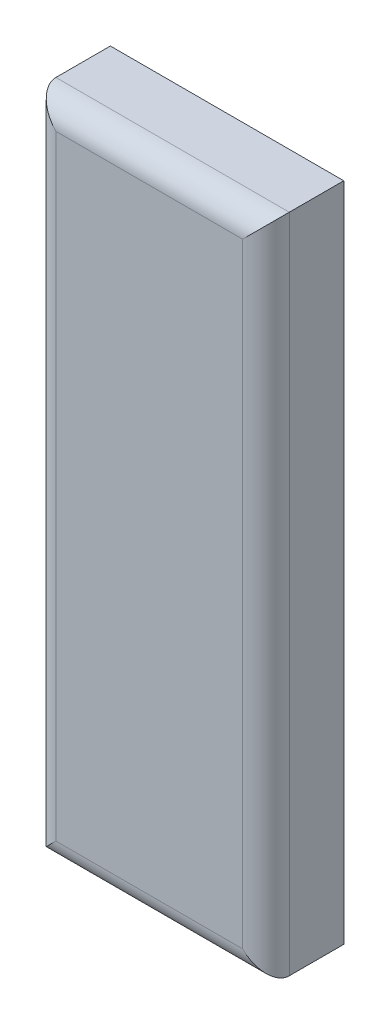
ISO-10303-21;
HEADER;
FILE_DESCRIPTION(('STEP AP214'),'2;1');
FILE_NAME('part.step','',(''),(''),'','','');
FILE_SCHEMA(('AUTOMOTIVE_DESIGN { 1 0 10303 214 1 1 1 1 }'));
ENDSEC;
DATA;
#1=APPLICATION_CONTEXT('core data for automotive mechanical design processes');
#2=APPLICATION_PROTOCOL_DEFINITION('international standard','automotive_design',2000,#1);
#3=PRODUCT_CONTEXT('',#1,'mechanical');
#4=PRODUCT('Part','Part','',(#3));
#5=PRODUCT_RELATED_PRODUCT_CATEGORY('part','',(#4));
#6=PRODUCT_DEFINITION_FORMATION('','',#4);
#7=PRODUCT_DEFINITION_CONTEXT('part definition',#1,'design');
#8=PRODUCT_DEFINITION('design','',#6,#7);
#9=PRODUCT_DEFINITION_SHAPE('','',#8);
#10=(LENGTH_UNIT() NAMED_UNIT(*) SI_UNIT(.MILLI.,.METRE.));
#11=(NAMED_UNIT(*) PLANE_ANGLE_UNIT() SI_UNIT($,.RADIAN.));
#12=(NAMED_UNIT(*) SI_UNIT($,.STERADIAN.) SOLID_ANGLE_UNIT());
#13=UNCERTAINTY_MEASURE_WITH_UNIT(LENGTH_MEASURE(1.E-05),#10,'distance_accuracy_value','');
#14=(GEOMETRIC_REPRESENTATION_CONTEXT(3) GLOBAL_UNCERTAINTY_ASSIGNED_CONTEXT((#13)) GLOBAL_UNIT_ASSIGNED_CONTEXT((#10,
#11,#12)) REPRESENTATION_CONTEXT('',''));
#15=CARTESIAN_POINT('',(0.,0.,0.));
#16=DIRECTION('',(0.,0.,1.));
#17=DIRECTION('',(1.,0.,0.));
#18=AXIS2_PLACEMENT_3D('',#15,#16,#17);
#19=CARTESIAN_POINT('',(0.,-5.2500000782311,2.));
#20=DIRECTION('',(0.,0.,1.));
#21=DIRECTION('',(1.,0.,0.));
#22=AXIS2_PLACEMENT_3D('',#19,#20,#21);
#23=PLANE('',#22);
#24=DIRECTION('',(1.,0.,0.));
#25=VECTOR('',#24,1.);
#26=CARTESIAN_POINT('',(-1.50000002235174,-1.00000001490116,2.));
#27=LINE('',#26,#25);
#28=CARTESIAN_POINT('',(-1.50000002235174,-1.00000001490116,2.));
#29=VERTEX_POINT('',#28);
#30=CARTESIAN_POINT('',(1.50000002235174,-1.00000001490116,2.));
#31=VERTEX_POINT('',#30);
#32=EDGE_CURVE('E137',#29,#31,#27,.T.);
#33=ORIENTED_EDGE('',*,*,#32,.T.);
#34=DIRECTION('',(0.,-1.,0.));
#35=VECTOR('',#34,1.);
#36=CARTESIAN_POINT('',(1.50000002235174,-1.00000001490116,2.));
#37=LINE('',#36,#35);
#38=CARTESIAN_POINT('',(1.50000002235174,-9.50000014156103,2.));
#39=VERTEX_POINT('',#38);
#40=EDGE_CURVE('E138',#31,#39,#37,.T.);
#41=ORIENTED_EDGE('',*,*,#40,.T.);
#42=DIRECTION('',(-1.,0.,0.));
#43=VECTOR('',#42,1.);
#44=CARTESIAN_POINT('',(1.50000002235174,-9.50000014156103,2.));
#45=LINE('',#44,#43);
#46=CARTESIAN_POINT('',(-1.50000002235174,-9.50000014156103,2.));
#47=VERTEX_POINT('',#46);
#48=EDGE_CURVE('E28',#39,#47,#45,.T.);
#49=ORIENTED_EDGE('',*,*,#48,.T.);
#50=DIRECTION('',(0.,1.,0.));
#51=VECTOR('',#50,1.);
#52=CARTESIAN_POINT('',(-1.50000002235174,-9.50000014156103,2.));
#53=LINE('',#52,#51);
#54=EDGE_CURVE('E11',#47,#29,#53,.T.);
#55=ORIENTED_EDGE('',*,*,#54,.T.);
#56=EDGE_LOOP('',(#33,#41,#49,#55));
#57=FACE_BOUND('',#56,.T.);
#58=ADVANCED_FACE('F17',(#57),#23,.F.);
#59=CARTESIAN_POINT('',(-1.50000002235174,-1.00000001490116,2.));
#60=DIRECTION('',(-1.,0.,0.));
#61=DIRECTION('',(0.,0.,1.));
#62=AXIS2_PLACEMENT_3D('',#59,#60,#61);
#63=PLANE('',#62);
#64=DIRECTION('',(0.,-1.,0.));
#65=VECTOR('',#64,1.);
#66=CARTESIAN_POINT('',(-1.50000002235174,-3.12500004656613,2.7));
#67=LINE('',#66,#65);
#68=CARTESIAN_POINT('',(-1.50000002235174,-1.00000001490116,2.7));
#69=VERTEX_POINT('',#68);
#70=CARTESIAN_POINT('',(-1.50000002235174,-9.50000014156103,2.7));
#71=VERTEX_POINT('',#70);
#72=EDGE_CURVE('E115',#69,#71,#67,.T.);
#73=ORIENTED_EDGE('',*,*,#72,.F.);
#74=DIRECTION('',(0.,0.,1.));
#75=VECTOR('',#74,1.);
#76=CARTESIAN_POINT('',(-1.50000002235174,-1.00000001490116,2.));
#77=LINE('',#76,#75);
#78=EDGE_CURVE('E151',#29,#69,#77,.T.);
#79=ORIENTED_EDGE('',*,*,#78,.F.);
#80=ORIENTED_EDGE('',*,*,#54,.F.);
#81=DIRECTION('',(0.,0.,1.));
#82=VECTOR('',#81,1.);
#83=CARTESIAN_POINT('',(-1.50000002235174,-9.50000014156103,2.));
#84=LINE('',#83,#82);
#85=EDGE_CURVE('E110',#47,#71,#84,.T.);
#86=ORIENTED_EDGE('',*,*,#85,.T.);
#87=EDGE_LOOP('',(#73,#79,#80,#86));
#88=FACE_BOUND('',#87,.T.);
#89=ADVANCED_FACE('F19',(#88),#63,.T.);
#90=CARTESIAN_POINT('',(-1.50000002235174,-9.50000014156103,2.));
#91=DIRECTION('',(0.,-1.,0.));
#92=DIRECTION('',(0.,0.,-1.));
#93=AXIS2_PLACEMENT_3D('',#90,#91,#92);
#94=PLANE('',#93);
#95=DIRECTION('',(1.,0.,0.));
#96=VECTOR('',#95,1.);
#97=CARTESIAN_POINT('',(-0.750000011175871,-9.50000014156103,2.7));
#98=LINE('',#97,#96);
#99=CARTESIAN_POINT('',(1.50000002235174,-9.50000014156103,2.7));
#100=VERTEX_POINT('',#99);
#101=EDGE_CURVE('E120',#71,#100,#98,.T.);
#102=ORIENTED_EDGE('',*,*,#101,.F.);
#103=ORIENTED_EDGE('',*,*,#85,.F.);
#104=ORIENTED_EDGE('',*,*,#48,.F.);
#105=DIRECTION('',(0.,0.,1.));
#106=VECTOR('',#105,1.);
#107=CARTESIAN_POINT('',(1.50000002235174,-9.50000014156103,2.));
#108=LINE('',#107,#106);
#109=EDGE_CURVE('E140',#39,#100,#108,.T.);
#110=ORIENTED_EDGE('',*,*,#109,.T.);
#111=EDGE_LOOP('',(#102,#103,#104,#110));
#112=FACE_BOUND('',#111,.T.);
#113=ADVANCED_FACE('F170',(#112),#94,.T.);
#114=CARTESIAN_POINT('',(0.,-5.2500000782311,3.));
#115=DIRECTION('',(0.,0.,1.));
#116=DIRECTION('',(1.,0.,0.));
#117=AXIS2_PLACEMENT_3D('',#114,#115,#116);
#118=PLANE('',#117);
#119=DIRECTION('',(0.,-1.,0.));
#120=VECTOR('',#119,1.);
#121=CARTESIAN_POINT('',(1.20000002235174,-7.37500010989606,3.));
#122=LINE('',#121,#120);
#123=CARTESIAN_POINT('',(1.20000002235174,-1.30000001490116,3.));
#124=VERTEX_POINT('',#123);
#125=CARTESIAN_POINT('',(1.20000002235174,-9.20000014156103,3.));
#126=VERTEX_POINT('',#125);
#127=EDGE_CURVE('E94',#124,#126,#122,.T.);
#128=ORIENTED_EDGE('',*,*,#127,.F.);
#129=DIRECTION('',(1.,0.,0.));
#130=VECTOR('',#129,1.);
#131=CARTESIAN_POINT('',(0.750000011175871,-1.30000001490116,3.));
#132=LINE('',#131,#130);
#133=CARTESIAN_POINT('',(-1.20000002235174,-1.30000001490116,3.));
#134=VERTEX_POINT('',#133);
#135=EDGE_CURVE('E74',#134,#124,#132,.T.);
#136=ORIENTED_EDGE('',*,*,#135,.F.);
#137=DIRECTION('',(0.,1.,0.));
#138=VECTOR('',#137,1.);
#139=CARTESIAN_POINT('',(-1.20000002235174,-3.12500004656613,3.));
#140=LINE('',#139,#138);
#141=CARTESIAN_POINT('',(-1.20000002235174,-9.20000014156103,3.));
#142=VERTEX_POINT('',#141);
#143=EDGE_CURVE('E116',#142,#134,#140,.T.);
#144=ORIENTED_EDGE('',*,*,#143,.F.);
#145=DIRECTION('',(-1.,0.,0.));
#146=VECTOR('',#145,1.);
#147=CARTESIAN_POINT('',(-0.750000011175871,-9.20000014156103,3.));
#148=LINE('',#147,#146);
#149=EDGE_CURVE('E97',#126,#142,#148,.T.);
#150=ORIENTED_EDGE('',*,*,#149,.F.);
#151=EDGE_LOOP('',(#128,#136,#144,#150));
#152=FACE_BOUND('',#151,.T.);
#153=ADVANCED_FACE('F99',(#152),#118,.T.);
#154=CARTESIAN_POINT('',(1.50000002235174,-9.50000014156103,2.));
#155=DIRECTION('',(1.,0.,0.));
#156=DIRECTION('',(0.,1.,0.));
#157=AXIS2_PLACEMENT_3D('',#154,#155,#156);
#158=PLANE('',#157);
#159=DIRECTION('',(0.,1.,0.));
#160=VECTOR('',#159,1.);
#161=CARTESIAN_POINT('',(1.50000002235174,-7.37500010989606,2.7));
#162=LINE('',#161,#160);
#163=CARTESIAN_POINT('',(1.50000002235174,-1.00000001490116,2.7));
#164=VERTEX_POINT('',#163);
#165=EDGE_CURVE('E21',#100,#164,#162,.T.);
#166=ORIENTED_EDGE('',*,*,#165,.F.);
#167=ORIENTED_EDGE('',*,*,#109,.F.);
#168=ORIENTED_EDGE('',*,*,#40,.F.);
#169=DIRECTION('',(0.,0.,1.));
#170=VECTOR('',#169,1.);
#171=CARTESIAN_POINT('',(1.50000002235174,-1.00000001490116,2.));
#172=LINE('',#171,#170);
#173=EDGE_CURVE('E87',#31,#164,#172,.T.);
#174=ORIENTED_EDGE('',*,*,#173,.T.);
#175=EDGE_LOOP('',(#166,#167,#168,#174));
#176=FACE_BOUND('',#175,.T.);
#177=ADVANCED_FACE('F168',(#176),#158,.T.);
#178=CARTESIAN_POINT('',(1.50000002235174,-1.00000001490116,2.));
#179=DIRECTION('',(0.,1.,0.));
#180=DIRECTION('',(1.,0.,0.));
#181=AXIS2_PLACEMENT_3D('',#178,#179,#180);
#182=PLANE('',#181);
#183=DIRECTION('',(-1.,0.,0.));
#184=VECTOR('',#183,1.);
#185=CARTESIAN_POINT('',(0.750000011175871,-1.00000001490116,2.7));
#186=LINE('',#185,#184);
#187=EDGE_CURVE('E88',#164,#69,#186,.T.);
#188=ORIENTED_EDGE('',*,*,#187,.F.);
#189=ORIENTED_EDGE('',*,*,#173,.F.);
#190=ORIENTED_EDGE('',*,*,#32,.F.);
#191=ORIENTED_EDGE('',*,*,#78,.T.);
#192=EDGE_LOOP('',(#188,#189,#190,#191));
#193=FACE_BOUND('',#192,.T.);
#194=ADVANCED_FACE('F166',(#193),#182,.T.);
#195=CARTESIAN_POINT('',(0.750000011175871,-1.30000001490116,2.7));
#196=DIRECTION('',(-1.,0.,0.));
#197=DIRECTION('',(0.,0.707106781186547,0.707106781186548));
#198=AXIS2_PLACEMENT_3D('',#195,#196,#197);
#199=CYLINDRICAL_SURFACE('',#198,0.3);
#200=ORIENTED_EDGE('',*,*,#187,.T.);
#201=CARTESIAN_POINT('',(-1.20000002235174,-1.30000001490116,2.7));
#202=DIRECTION('',(-0.707106781186548,-0.707106781186548,0.));
#203=DIRECTION('',(-0.707106781186548,0.707106781186548,0.));
#204=AXIS2_PLACEMENT_3D('',#201,#202,#203);
#205=ELLIPSE('',#204,0.424264068711929,0.3);
#206=EDGE_CURVE('E81',#134,#69,#205,.T.);
#207=ORIENTED_EDGE('',*,*,#206,.F.);
#208=ORIENTED_EDGE('',*,*,#135,.T.);
#209=CARTESIAN_POINT('',(1.20000002235174,-1.30000001490116,2.7));
#210=DIRECTION('',(-0.707106781186548,0.707106781186548,0.));
#211=DIRECTION('',(0.707106781186548,0.707106781186548,0.));
#212=AXIS2_PLACEMENT_3D('',#209,#210,#211);
#213=ELLIPSE('',#212,0.424264068711929,0.3);
#214=EDGE_CURVE('E78',#124,#164,#213,.T.);
#215=ORIENTED_EDGE('',*,*,#214,.T.);
#216=EDGE_LOOP('',(#200,#207,#208,#215));
#217=FACE_BOUND('',#216,.T.);
#218=ADVANCED_FACE('F77',(#217),#199,.T.);
#219=CARTESIAN_POINT('',(-1.20000002235174,-3.12500004656613,2.7));
#220=DIRECTION('',(0.,-1.,0.));
#221=DIRECTION('',(-0.707106781186547,0.,0.707106781186548));
#222=AXIS2_PLACEMENT_3D('',#219,#220,#221);
#223=CYLINDRICAL_SURFACE('',#222,0.3);
#224=ORIENTED_EDGE('',*,*,#143,.T.);
#225=ORIENTED_EDGE('',*,*,#206,.T.);
#226=ORIENTED_EDGE('',*,*,#72,.T.);
#227=CARTESIAN_POINT('',(-1.20000002235174,-9.20000014156103,2.7));
#228=DIRECTION('',(0.707106781186548,-0.707106781186547,0.));
#229=DIRECTION('',(-0.707106781186547,-0.707106781186548,0.));
#230=AXIS2_PLACEMENT_3D('',#227,#228,#229);
#231=ELLIPSE('',#230,0.424264068711928,0.3);
#232=EDGE_CURVE('E117',#142,#71,#231,.T.);
#233=ORIENTED_EDGE('',*,*,#232,.F.);
#234=EDGE_LOOP('',(#224,#225,#226,#233));
#235=FACE_BOUND('',#234,.T.);
#236=ADVANCED_FACE('F174',(#235),#223,.T.);
#237=CARTESIAN_POINT('',(-0.750000011175871,-9.20000014156103,2.7));
#238=DIRECTION('',(1.,0.,0.));
#239=DIRECTION('',(0.,-0.707106781186548,0.707106781186548));
#240=AXIS2_PLACEMENT_3D('',#237,#238,#239);
#241=CYLINDRICAL_SURFACE('',#240,0.3);
#242=ORIENTED_EDGE('',*,*,#149,.T.);
#243=ORIENTED_EDGE('',*,*,#232,.T.);
#244=ORIENTED_EDGE('',*,*,#101,.T.);
#245=CARTESIAN_POINT('',(1.20000002235174,-9.20000014156103,2.7));
#246=DIRECTION('',(0.707106781186548,0.707106781186547,0.));
#247=DIRECTION('',(0.707106781186547,-0.707106781186548,0.));
#248=AXIS2_PLACEMENT_3D('',#245,#246,#247);
#249=ELLIPSE('',#248,0.424264068711929,0.3);
#250=EDGE_CURVE('E103',#126,#100,#249,.T.);
#251=ORIENTED_EDGE('',*,*,#250,.F.);
#252=EDGE_LOOP('',(#242,#243,#244,#251));
#253=FACE_BOUND('',#252,.T.);
#254=ADVANCED_FACE('F173',(#253),#241,.T.);
#255=CARTESIAN_POINT('',(1.20000002235174,-7.37500010989606,2.7));
#256=DIRECTION('',(0.,1.,0.));
#257=DIRECTION('',(0.707106781186547,0.,0.707106781186548));
#258=AXIS2_PLACEMENT_3D('',#255,#256,#257);
#259=CYLINDRICAL_SURFACE('',#258,0.3);
#260=ORIENTED_EDGE('',*,*,#127,.T.);
#261=ORIENTED_EDGE('',*,*,#250,.T.);
#262=ORIENTED_EDGE('',*,*,#165,.T.);
#263=ORIENTED_EDGE('',*,*,#214,.F.);
#264=EDGE_LOOP('',(#260,#261,#262,#263));
#265=FACE_BOUND('',#264,.T.);
#266=ADVANCED_FACE('F92',(#265),#259,.T.);
#267=CLOSED_SHELL('',(#58,#89,#113,#153,#177,#194,#218,#236,#254,#266));
#268=MANIFOLD_SOLID_BREP('B1',#267);
#269=ADVANCED_BREP_SHAPE_REPRESENTATION('',(#18,#268),#14);
#270=SHAPE_DEFINITION_REPRESENTATION(#9,#269);
ENDSEC;
END-ISO-10303-21;
